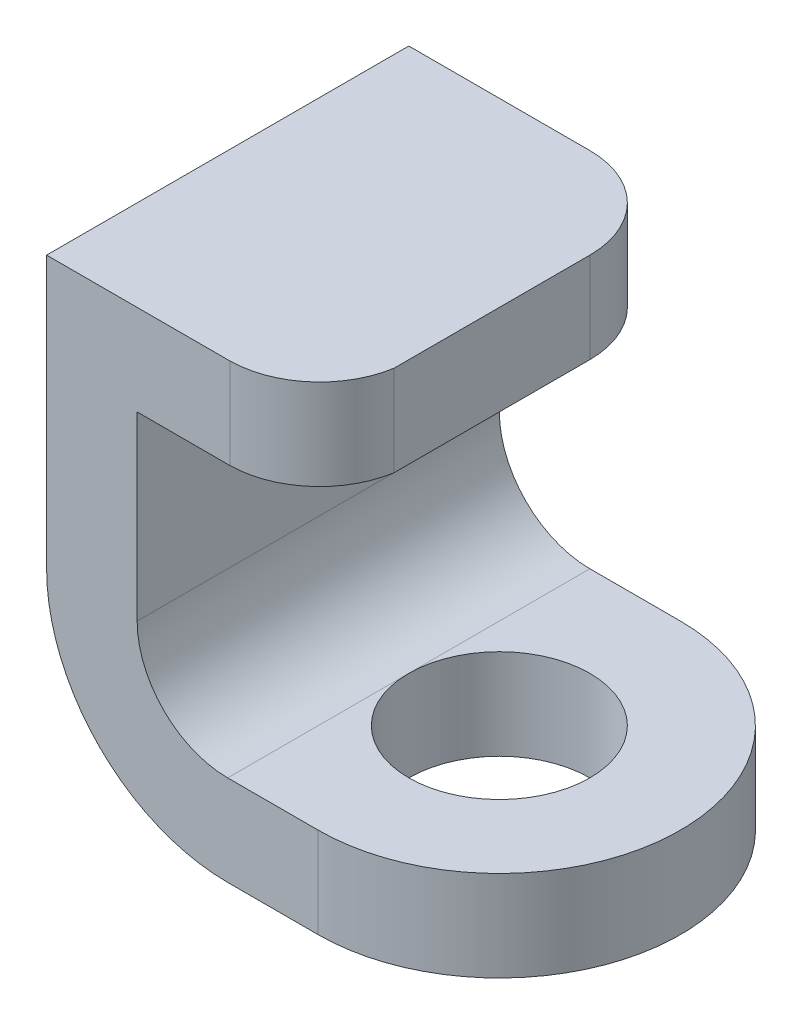
ISO-10303-21;
HEADER;
FILE_DESCRIPTION(('STEP AP214'),'2;1');
FILE_NAME('part.step','',(''),(''),'','','');
FILE_SCHEMA(('AUTOMOTIVE_DESIGN { 1 0 10303 214 1 1 1 1 }'));
ENDSEC;
DATA;
#1=APPLICATION_CONTEXT('core data for automotive mechanical design processes');
#2=APPLICATION_PROTOCOL_DEFINITION('international standard','automotive_design',2000,#1);
#3=PRODUCT_CONTEXT('',#1,'mechanical');
#4=PRODUCT('Part','Part','',(#3));
#5=PRODUCT_RELATED_PRODUCT_CATEGORY('part','',(#4));
#6=PRODUCT_DEFINITION_FORMATION('','',#4);
#7=PRODUCT_DEFINITION_CONTEXT('part definition',#1,'design');
#8=PRODUCT_DEFINITION('design','',#6,#7);
#9=PRODUCT_DEFINITION_SHAPE('','',#8);
#10=(LENGTH_UNIT() NAMED_UNIT(*) SI_UNIT(.MILLI.,.METRE.));
#11=(NAMED_UNIT(*) PLANE_ANGLE_UNIT() SI_UNIT($,.RADIAN.));
#12=(NAMED_UNIT(*) SI_UNIT($,.STERADIAN.) SOLID_ANGLE_UNIT());
#13=UNCERTAINTY_MEASURE_WITH_UNIT(LENGTH_MEASURE(1.E-05),#10,'distance_accuracy_value','');
#14=(GEOMETRIC_REPRESENTATION_CONTEXT(3) GLOBAL_UNCERTAINTY_ASSIGNED_CONTEXT((#13)) GLOBAL_UNIT_ASSIGNED_CONTEXT((#10,
#11,#12)) REPRESENTATION_CONTEXT('',''));
#15=CARTESIAN_POINT('',(0.,0.,0.));
#16=DIRECTION('',(0.,0.,1.));
#17=DIRECTION('',(1.,0.,0.));
#18=AXIS2_PLACEMENT_3D('',#15,#16,#17);
#19=CARTESIAN_POINT('',(-9.99999999999999,-50.,40.));
#20=DIRECTION('',(0.,1.,0.));
#21=DIRECTION('',(0.,0.,1.));
#22=AXIS2_PLACEMENT_3D('',#19,#20,#21);
#23=PLANE('',#22);
#24=CARTESIAN_POINT('',(0.,-50.,20.));
#25=DIRECTION('',(0.,1.,0.));
#26=DIRECTION('',(0.,0.,1.));
#27=AXIS2_PLACEMENT_3D('',#24,#25,#26);
#28=CIRCLE('',#27,20.);
#29=CARTESIAN_POINT('',(0.,-50.,40.));
#30=VERTEX_POINT('',#29);
#31=CARTESIAN_POINT('',(0.,-50.,0.));
#32=VERTEX_POINT('',#31);
#33=EDGE_CURVE('E178',#30,#32,#28,.T.);
#34=ORIENTED_EDGE('',*,*,#33,.F.);
#35=DIRECTION('',(1.,0.,0.));
#36=VECTOR('',#35,1.);
#37=CARTESIAN_POINT('',(-9.99999999999999,-50.,40.));
#38=LINE('',#37,#36);
#39=CARTESIAN_POINT('',(-10.,-50.,40.));
#40=VERTEX_POINT('',#39);
#41=EDGE_CURVE('E187',#40,#30,#38,.T.);
#42=ORIENTED_EDGE('',*,*,#41,.F.);
#43=DIRECTION('',(0.,0.,-1.));
#44=VECTOR('',#43,1.);
#45=CARTESIAN_POINT('',(-10.,-50.,40.));
#46=LINE('',#45,#44);
#47=CARTESIAN_POINT('',(-10.,-50.,20.));
#48=VERTEX_POINT('',#47);
#49=EDGE_CURVE('E230',#40,#48,#46,.T.);
#50=ORIENTED_EDGE('',*,*,#49,.T.);
#51=CARTESIAN_POINT('',(0.,-50.,20.));
#52=DIRECTION('',(0.,1.,0.));
#53=DIRECTION('',(0.,0.,1.));
#54=AXIS2_PLACEMENT_3D('',#51,#52,#53);
#55=CIRCLE('',#54,10.);
#56=EDGE_CURVE('E92',#48,#48,#55,.T.);
#57=ORIENTED_EDGE('',*,*,#56,.T.);
#58=CARTESIAN_POINT('',(-10.,-50.,0.));
#59=VERTEX_POINT('',#58);
#60=EDGE_CURVE('E209',#48,#59,#46,.T.);
#61=ORIENTED_EDGE('',*,*,#60,.T.);
#62=DIRECTION('',(1.,0.,0.));
#63=VECTOR('',#62,1.);
#64=CARTESIAN_POINT('',(-9.99999999999999,-50.,0.));
#65=LINE('',#64,#63);
#66=EDGE_CURVE('E210',#59,#32,#65,.T.);
#67=ORIENTED_EDGE('',*,*,#66,.T.);
#68=EDGE_LOOP('',(#34,#42,#50,#57,#61,#67));
#69=FACE_BOUND('',#68,.T.);
#70=ADVANCED_FACE('F75',(#69),#23,.F.);
#71=CARTESIAN_POINT('',(-9.99999999999999,-40.,40.));
#72=DIRECTION('',(0.,1.,0.));
#73=DIRECTION('',(0.,0.,1.));
#74=AXIS2_PLACEMENT_3D('',#71,#72,#73);
#75=PLANE('',#74);
#76=DIRECTION('',(1.,0.,0.));
#77=VECTOR('',#76,1.);
#78=CARTESIAN_POINT('',(-9.99999999999999,-40.,40.));
#79=LINE('',#78,#77);
#80=CARTESIAN_POINT('',(-10.,-40.,40.));
#81=VERTEX_POINT('',#80);
#82=CARTESIAN_POINT('',(0.,-40.,40.));
#83=VERTEX_POINT('',#82);
#84=EDGE_CURVE('E184',#81,#83,#79,.T.);
#85=ORIENTED_EDGE('',*,*,#84,.T.);
#86=CARTESIAN_POINT('',(0.,-40.,20.));
#87=DIRECTION('',(0.,1.,0.));
#88=DIRECTION('',(0.,0.,1.));
#89=AXIS2_PLACEMENT_3D('',#86,#87,#88);
#90=CIRCLE('',#89,20.);
#91=CARTESIAN_POINT('',(0.,-40.,0.));
#92=VERTEX_POINT('',#91);
#93=EDGE_CURVE('E167',#83,#92,#90,.T.);
#94=ORIENTED_EDGE('',*,*,#93,.T.);
#95=DIRECTION('',(1.,0.,0.));
#96=VECTOR('',#95,1.);
#97=CARTESIAN_POINT('',(-9.99999999999999,-40.,0.));
#98=LINE('',#97,#96);
#99=CARTESIAN_POINT('',(-10.,-40.,0.));
#100=VERTEX_POINT('',#99);
#101=EDGE_CURVE('E213',#100,#92,#98,.T.);
#102=ORIENTED_EDGE('',*,*,#101,.F.);
#103=DIRECTION('',(0.,0.,-1.));
#104=VECTOR('',#103,1.);
#105=CARTESIAN_POINT('',(-10.,-40.,40.));
#106=LINE('',#105,#104);
#107=CARTESIAN_POINT('',(-10.,-40.,20.));
#108=VERTEX_POINT('',#107);
#109=EDGE_CURVE('E249',#108,#100,#106,.T.);
#110=ORIENTED_EDGE('',*,*,#109,.F.);
#111=CARTESIAN_POINT('',(0.,-40.,20.));
#112=DIRECTION('',(0.,1.,0.));
#113=DIRECTION('',(0.,0.,1.));
#114=AXIS2_PLACEMENT_3D('',#111,#112,#113);
#115=CIRCLE('',#114,10.);
#116=EDGE_CURVE('E87',#108,#108,#115,.T.);
#117=ORIENTED_EDGE('',*,*,#116,.F.);
#118=EDGE_CURVE('E82',#81,#108,#106,.T.);
#119=ORIENTED_EDGE('',*,*,#118,.F.);
#120=EDGE_LOOP('',(#85,#94,#102,#110,#117,#119));
#121=FACE_BOUND('',#120,.T.);
#122=ADVANCED_FACE('F189',(#121),#75,.T.);
#123=CARTESIAN_POINT('',(-9.99999999999999,-30.,40.));
#124=DIRECTION('',(0.,0.,1.));
#125=DIRECTION('',(1.,0.,0.));
#126=AXIS2_PLACEMENT_3D('',#123,#124,#125);
#127=PLANE('',#126);
#128=ORIENTED_EDGE('',*,*,#41,.T.);
#129=DIRECTION('',(0.,1.,0.));
#130=VECTOR('',#129,1.);
#131=CARTESIAN_POINT('',(0.,-50.,40.));
#132=LINE('',#131,#130);
#133=EDGE_CURVE('E170',#30,#83,#132,.T.);
#134=ORIENTED_EDGE('',*,*,#133,.T.);
#135=ORIENTED_EDGE('',*,*,#84,.F.);
#136=CARTESIAN_POINT('',(-9.99999999999999,-30.,40.));
#137=DIRECTION('',(0.,0.,1.));
#138=DIRECTION('',(1.,0.,0.));
#139=AXIS2_PLACEMENT_3D('',#136,#137,#138);
#140=CIRCLE('',#139,10.);
#141=CARTESIAN_POINT('',(-20.,-30.,40.));
#142=VERTEX_POINT('',#141);
#143=EDGE_CURVE('E191',#142,#81,#140,.T.);
#144=ORIENTED_EDGE('',*,*,#143,.F.);
#145=DIRECTION('',(0.,-1.,0.));
#146=VECTOR('',#145,1.);
#147=CARTESIAN_POINT('',(-20.,0.,40.));
#148=LINE('',#147,#146);
#149=CARTESIAN_POINT('',(-20.,-10.,40.));
#150=VERTEX_POINT('',#149);
#151=EDGE_CURVE('E193',#150,#142,#148,.T.);
#152=ORIENTED_EDGE('',*,*,#151,.F.);
#153=DIRECTION('',(-1.,0.,0.));
#154=VECTOR('',#153,1.);
#155=CARTESIAN_POINT('',(0.,-10.,40.));
#156=LINE('',#155,#154);
#157=CARTESIAN_POINT('',(-9.72613862722199,-10.,40.));
#158=VERTEX_POINT('',#157);
#159=EDGE_CURVE('E201',#158,#150,#156,.T.);
#160=ORIENTED_EDGE('',*,*,#159,.F.);
#161=DIRECTION('',(0.,1.,0.));
#162=VECTOR('',#161,1.);
#163=CARTESIAN_POINT('',(-9.72613862722199,-10.,40.));
#164=LINE('',#163,#162);
#165=CARTESIAN_POINT('',(-9.72613862722199,0.,40.));
#166=VERTEX_POINT('',#165);
#167=EDGE_CURVE('E12',#158,#166,#164,.T.);
#168=ORIENTED_EDGE('',*,*,#167,.T.);
#169=DIRECTION('',(-1.,0.,0.));
#170=VECTOR('',#169,1.);
#171=CARTESIAN_POINT('',(0.,0.,40.));
#172=LINE('',#171,#170);
#173=CARTESIAN_POINT('',(-30.,0.,40.));
#174=VERTEX_POINT('',#173);
#175=EDGE_CURVE('E203',#166,#174,#172,.T.);
#176=ORIENTED_EDGE('',*,*,#175,.T.);
#177=DIRECTION('',(0.,-1.,0.));
#178=VECTOR('',#177,1.);
#179=CARTESIAN_POINT('',(-30.,0.,40.));
#180=LINE('',#179,#178);
#181=CARTESIAN_POINT('',(-30.,-30.,40.));
#182=VERTEX_POINT('',#181);
#183=EDGE_CURVE('E205',#174,#182,#180,.T.);
#184=ORIENTED_EDGE('',*,*,#183,.T.);
#185=CARTESIAN_POINT('',(-9.99999999999999,-30.,40.));
#186=DIRECTION('',(0.,0.,1.));
#187=DIRECTION('',(1.,0.,0.));
#188=AXIS2_PLACEMENT_3D('',#185,#186,#187);
#189=CIRCLE('',#188,20.);
#190=EDGE_CURVE('E207',#182,#40,#189,.T.);
#191=ORIENTED_EDGE('',*,*,#190,.T.);
#192=EDGE_LOOP('',(#128,#134,#135,#144,#152,#160,#168,#176,#184,#191));
#193=FACE_BOUND('',#192,.T.);
#194=ADVANCED_FACE('F182',(#193),#127,.T.);
#195=CARTESIAN_POINT('',(-9.99999999999999,-30.,0.));
#196=DIRECTION('',(0.,0.,1.));
#197=DIRECTION('',(1.,0.,0.));
#198=AXIS2_PLACEMENT_3D('',#195,#196,#197);
#199=PLANE('',#198);
#200=DIRECTION('',(0.,1.,0.));
#201=VECTOR('',#200,1.);
#202=CARTESIAN_POINT('',(0.,-50.,0.));
#203=LINE('',#202,#201);
#204=EDGE_CURVE('E173',#32,#92,#203,.T.);
#205=ORIENTED_EDGE('',*,*,#204,.F.);
#206=ORIENTED_EDGE('',*,*,#66,.F.);
#207=CARTESIAN_POINT('',(-9.99999999999999,-30.,0.));
#208=DIRECTION('',(0.,0.,1.));
#209=DIRECTION('',(1.,0.,0.));
#210=AXIS2_PLACEMENT_3D('',#207,#208,#209);
#211=CIRCLE('',#210,20.);
#212=CARTESIAN_POINT('',(-30.,-30.,0.));
#213=VERTEX_POINT('',#212);
#214=EDGE_CURVE('E195',#213,#59,#211,.T.);
#215=ORIENTED_EDGE('',*,*,#214,.F.);
#216=DIRECTION('',(0.,-1.,0.));
#217=VECTOR('',#216,1.);
#218=CARTESIAN_POINT('',(-30.,0.,0.));
#219=LINE('',#218,#217);
#220=CARTESIAN_POINT('',(-30.,0.,0.));
#221=VERTEX_POINT('',#220);
#222=EDGE_CURVE('E226',#221,#213,#219,.T.);
#223=ORIENTED_EDGE('',*,*,#222,.F.);
#224=DIRECTION('',(-1.,0.,0.));
#225=VECTOR('',#224,1.);
#226=CARTESIAN_POINT('',(0.,0.,0.));
#227=LINE('',#226,#225);
#228=CARTESIAN_POINT('',(-10.,0.,0.));
#229=VERTEX_POINT('',#228);
#230=EDGE_CURVE('E224',#229,#221,#227,.T.);
#231=ORIENTED_EDGE('',*,*,#230,.F.);
#232=DIRECTION('',(0.,1.,0.));
#233=VECTOR('',#232,1.);
#234=CARTESIAN_POINT('',(-9.99999999999999,-10.,0.));
#235=LINE('',#234,#233);
#236=CARTESIAN_POINT('',(-9.99999999999999,-10.,0.));
#237=VERTEX_POINT('',#236);
#238=EDGE_CURVE('E279',#237,#229,#235,.T.);
#239=ORIENTED_EDGE('',*,*,#238,.F.);
#240=DIRECTION('',(-1.,0.,0.));
#241=VECTOR('',#240,1.);
#242=CARTESIAN_POINT('',(0.,-10.,0.));
#243=LINE('',#242,#241);
#244=CARTESIAN_POINT('',(-20.,-10.,0.));
#245=VERTEX_POINT('',#244);
#246=EDGE_CURVE('E222',#237,#245,#243,.T.);
#247=ORIENTED_EDGE('',*,*,#246,.T.);
#248=DIRECTION('',(0.,-1.,0.));
#249=VECTOR('',#248,1.);
#250=CARTESIAN_POINT('',(-20.,0.,0.));
#251=LINE('',#250,#249);
#252=CARTESIAN_POINT('',(-20.,-30.,0.));
#253=VERTEX_POINT('',#252);
#254=EDGE_CURVE('E219',#245,#253,#251,.T.);
#255=ORIENTED_EDGE('',*,*,#254,.T.);
#256=CARTESIAN_POINT('',(-9.99999999999999,-30.,0.));
#257=DIRECTION('',(0.,0.,1.));
#258=DIRECTION('',(1.,0.,0.));
#259=AXIS2_PLACEMENT_3D('',#256,#257,#258);
#260=CIRCLE('',#259,10.);
#261=EDGE_CURVE('E216',#253,#100,#260,.T.);
#262=ORIENTED_EDGE('',*,*,#261,.T.);
#263=ORIENTED_EDGE('',*,*,#101,.T.);
#264=EDGE_LOOP('',(#205,#206,#215,#223,#231,#239,#247,#255,#262,#263));
#265=FACE_BOUND('',#264,.T.);
#266=ADVANCED_FACE('F255',(#265),#199,.F.);
#267=CARTESIAN_POINT('',(0.,-10.,40.));
#268=DIRECTION('',(0.,-1.,0.));
#269=DIRECTION('',(1.,0.,0.));
#270=AXIS2_PLACEMENT_3D('',#267,#268,#269);
#271=PLANE('',#270);
#272=ORIENTED_EDGE('',*,*,#246,.F.);
#273=CARTESIAN_POINT('',(-10.,-10.,10.));
#274=DIRECTION('',(0.,1.,0.));
#275=DIRECTION('',(-1.,0.,0.));
#276=AXIS2_PLACEMENT_3D('',#273,#274,#275);
#277=CIRCLE('',#276,10.);
#278=CARTESIAN_POINT('',(0.,-10.,10.));
#279=VERTEX_POINT('',#278);
#280=EDGE_CURVE('E281',#279,#237,#277,.T.);
#281=ORIENTED_EDGE('',*,*,#280,.F.);
#282=DIRECTION('',(0.,0.,-1.));
#283=VECTOR('',#282,1.);
#284=CARTESIAN_POINT('',(0.,-10.,40.));
#285=LINE('',#284,#283);
#286=CARTESIAN_POINT('',(0.,-10.,31.6501384768344));
#287=VERTEX_POINT('',#286);
#288=EDGE_CURVE('E242',#287,#279,#285,.T.);
#289=ORIENTED_EDGE('',*,*,#288,.F.);
#290=CARTESIAN_POINT('',(-9.86306931361099,-10.,30.0009375445932));
#291=DIRECTION('',(0.,1.,0.));
#292=DIRECTION('',(-1.,0.,0.));
#293=AXIS2_PLACEMENT_3D('',#290,#291,#292);
#294=CIRCLE('',#293,10.);
#295=EDGE_CURVE('E269',#158,#287,#294,.T.);
#296=ORIENTED_EDGE('',*,*,#295,.F.);
#297=ORIENTED_EDGE('',*,*,#159,.T.);
#298=DIRECTION('',(0.,0.,-1.));
#299=VECTOR('',#298,1.);
#300=CARTESIAN_POINT('',(-20.,-10.,40.));
#301=LINE('',#300,#299);
#302=EDGE_CURVE('E245',#150,#245,#301,.T.);
#303=ORIENTED_EDGE('',*,*,#302,.T.);
#304=EDGE_LOOP('',(#272,#281,#289,#296,#297,#303));
#305=FACE_BOUND('',#304,.T.);
#306=ADVANCED_FACE('F267',(#305),#271,.T.);
#307=CARTESIAN_POINT('',(0.,0.,40.));
#308=DIRECTION('',(1.,0.,0.));
#309=DIRECTION('',(0.,1.,0.));
#310=AXIS2_PLACEMENT_3D('',#307,#308,#309);
#311=PLANE('',#310);
#312=ORIENTED_EDGE('',*,*,#288,.T.);
#313=DIRECTION('',(0.,1.,0.));
#314=VECTOR('',#313,1.);
#315=CARTESIAN_POINT('',(0.,-10.,10.));
#316=LINE('',#315,#314);
#317=CARTESIAN_POINT('',(0.,0.,10.));
#318=VERTEX_POINT('',#317);
#319=EDGE_CURVE('E276',#279,#318,#316,.T.);
#320=ORIENTED_EDGE('',*,*,#319,.T.);
#321=DIRECTION('',(0.,0.,-1.));
#322=VECTOR('',#321,1.);
#323=CARTESIAN_POINT('',(0.,0.,40.));
#324=LINE('',#323,#322);
#325=CARTESIAN_POINT('',(0.,0.,31.6501384768344));
#326=VERTEX_POINT('',#325);
#327=EDGE_CURVE('E239',#326,#318,#324,.T.);
#328=ORIENTED_EDGE('',*,*,#327,.F.);
#329=DIRECTION('',(0.,1.,0.));
#330=VECTOR('',#329,1.);
#331=CARTESIAN_POINT('',(0.,-10.,31.6501384768344));
#332=LINE('',#331,#330);
#333=EDGE_CURVE('E214',#287,#326,#332,.T.);
#334=ORIENTED_EDGE('',*,*,#333,.F.);
#335=EDGE_LOOP('',(#312,#320,#328,#334));
#336=FACE_BOUND('',#335,.T.);
#337=ADVANCED_FACE('F312',(#336),#311,.T.);
#338=CARTESIAN_POINT('',(0.,0.,40.));
#339=DIRECTION('',(0.,-1.,0.));
#340=DIRECTION('',(1.,0.,0.));
#341=AXIS2_PLACEMENT_3D('',#338,#339,#340);
#342=PLANE('',#341);
#343=CARTESIAN_POINT('',(-10.,0.,10.));
#344=DIRECTION('',(0.,1.,0.));
#345=DIRECTION('',(-1.,0.,0.));
#346=AXIS2_PLACEMENT_3D('',#343,#344,#345);
#347=CIRCLE('',#346,10.);
#348=EDGE_CURVE('E284',#318,#229,#347,.T.);
#349=ORIENTED_EDGE('',*,*,#348,.T.);
#350=ORIENTED_EDGE('',*,*,#230,.T.);
#351=DIRECTION('',(0.,0.,-1.));
#352=VECTOR('',#351,1.);
#353=CARTESIAN_POINT('',(-30.,0.,40.));
#354=LINE('',#353,#352);
#355=EDGE_CURVE('E236',#174,#221,#354,.T.);
#356=ORIENTED_EDGE('',*,*,#355,.F.);
#357=ORIENTED_EDGE('',*,*,#175,.F.);
#358=CARTESIAN_POINT('',(-9.863069313611,0.,30.0009375445932));
#359=DIRECTION('',(0.,1.,0.));
#360=DIRECTION('',(-1.,0.,0.));
#361=AXIS2_PLACEMENT_3D('',#358,#359,#360);
#362=CIRCLE('',#361,10.);
#363=EDGE_CURVE('E273',#166,#326,#362,.T.);
#364=ORIENTED_EDGE('',*,*,#363,.T.);
#365=ORIENTED_EDGE('',*,*,#327,.T.);
#366=EDGE_LOOP('',(#349,#350,#356,#357,#364,#365));
#367=FACE_BOUND('',#366,.T.);
#368=ADVANCED_FACE('F307',(#367),#342,.F.);
#369=CARTESIAN_POINT('',(-9.99999999999999,-30.,40.));
#370=DIRECTION('',(0.,0.,-1.));
#371=DIRECTION('',(-1.,0.,0.));
#372=AXIS2_PLACEMENT_3D('',#369,#370,#371);
#373=CYLINDRICAL_SURFACE('',#372,10.);
#374=ORIENTED_EDGE('',*,*,#261,.F.);
#375=DIRECTION('',(0.,0.,-1.));
#376=VECTOR('',#375,1.);
#377=CARTESIAN_POINT('',(-20.,-30.,40.));
#378=LINE('',#377,#376);
#379=EDGE_CURVE('E248',#142,#253,#378,.T.);
#380=ORIENTED_EDGE('',*,*,#379,.F.);
#381=ORIENTED_EDGE('',*,*,#143,.T.);
#382=ORIENTED_EDGE('',*,*,#118,.T.);
#383=ORIENTED_EDGE('',*,*,#109,.T.);
#384=EDGE_LOOP('',(#374,#380,#381,#382,#383));
#385=FACE_BOUND('',#384,.T.);
#386=ADVANCED_FACE('F253',(#385),#373,.F.);
#387=CARTESIAN_POINT('',(-20.,0.,40.));
#388=DIRECTION('',(1.,0.,0.));
#389=DIRECTION('',(0.,1.,0.));
#390=AXIS2_PLACEMENT_3D('',#387,#388,#389);
#391=PLANE('',#390);
#392=ORIENTED_EDGE('',*,*,#254,.F.);
#393=ORIENTED_EDGE('',*,*,#302,.F.);
#394=ORIENTED_EDGE('',*,*,#151,.T.);
#395=ORIENTED_EDGE('',*,*,#379,.T.);
#396=EDGE_LOOP('',(#392,#393,#394,#395));
#397=FACE_BOUND('',#396,.T.);
#398=ADVANCED_FACE('F261',(#397),#391,.T.);
#399=CARTESIAN_POINT('',(-30.,0.,40.));
#400=DIRECTION('',(1.,0.,0.));
#401=DIRECTION('',(0.,1.,0.));
#402=AXIS2_PLACEMENT_3D('',#399,#400,#401);
#403=PLANE('',#402);
#404=ORIENTED_EDGE('',*,*,#222,.T.);
#405=DIRECTION('',(0.,0.,-1.));
#406=VECTOR('',#405,1.);
#407=CARTESIAN_POINT('',(-30.,-30.,40.));
#408=LINE('',#407,#406);
#409=EDGE_CURVE('E233',#182,#213,#408,.T.);
#410=ORIENTED_EDGE('',*,*,#409,.F.);
#411=ORIENTED_EDGE('',*,*,#183,.F.);
#412=ORIENTED_EDGE('',*,*,#355,.T.);
#413=EDGE_LOOP('',(#404,#410,#411,#412));
#414=FACE_BOUND('',#413,.T.);
#415=ADVANCED_FACE('F303',(#414),#403,.F.);
#416=CARTESIAN_POINT('',(-9.99999999999999,-30.,40.));
#417=DIRECTION('',(0.,0.,-1.));
#418=DIRECTION('',(-1.,0.,0.));
#419=AXIS2_PLACEMENT_3D('',#416,#417,#418);
#420=CYLINDRICAL_SURFACE('',#419,20.);
#421=ORIENTED_EDGE('',*,*,#214,.T.);
#422=ORIENTED_EDGE('',*,*,#60,.F.);
#423=ORIENTED_EDGE('',*,*,#49,.F.);
#424=ORIENTED_EDGE('',*,*,#190,.F.);
#425=ORIENTED_EDGE('',*,*,#409,.T.);
#426=EDGE_LOOP('',(#421,#422,#423,#424,#425));
#427=FACE_BOUND('',#426,.T.);
#428=ADVANCED_FACE('F295',(#427),#420,.T.);
#429=CARTESIAN_POINT('',(-9.86306931361099,-10.,30.0009375445932));
#430=DIRECTION('',(0.,1.,0.));
#431=DIRECTION('',(-1.,0.,0.));
#432=AXIS2_PLACEMENT_3D('',#429,#430,#431);
#433=CYLINDRICAL_SURFACE('',#432,10.);
#434=ORIENTED_EDGE('',*,*,#295,.T.);
#435=ORIENTED_EDGE('',*,*,#333,.T.);
#436=ORIENTED_EDGE('',*,*,#363,.F.);
#437=ORIENTED_EDGE('',*,*,#167,.F.);
#438=EDGE_LOOP('',(#434,#435,#436,#437));
#439=FACE_BOUND('',#438,.T.);
#440=ADVANCED_FACE('F313',(#439),#433,.T.);
#441=CARTESIAN_POINT('',(-10.,-10.,10.));
#442=DIRECTION('',(0.,1.,0.));
#443=DIRECTION('',(-1.,0.,0.));
#444=AXIS2_PLACEMENT_3D('',#441,#442,#443);
#445=CYLINDRICAL_SURFACE('',#444,10.);
#446=ORIENTED_EDGE('',*,*,#348,.F.);
#447=ORIENTED_EDGE('',*,*,#319,.F.);
#448=ORIENTED_EDGE('',*,*,#280,.T.);
#449=ORIENTED_EDGE('',*,*,#238,.T.);
#450=EDGE_LOOP('',(#446,#447,#448,#449));
#451=FACE_BOUND('',#450,.T.);
#452=ADVANCED_FACE('F310',(#451),#445,.T.);
#453=CARTESIAN_POINT('',(0.,-50.,20.));
#454=DIRECTION('',(0.,1.,0.));
#455=DIRECTION('',(0.,0.,1.));
#456=AXIS2_PLACEMENT_3D('',#453,#454,#455);
#457=CYLINDRICAL_SURFACE('',#456,20.);
#458=ORIENTED_EDGE('',*,*,#93,.F.);
#459=ORIENTED_EDGE('',*,*,#133,.F.);
#460=ORIENTED_EDGE('',*,*,#33,.T.);
#461=ORIENTED_EDGE('',*,*,#204,.T.);
#462=EDGE_LOOP('',(#458,#459,#460,#461));
#463=FACE_BOUND('',#462,.T.);
#464=ADVANCED_FACE('F169',(#463),#457,.T.);
#465=CARTESIAN_POINT('',(0.,-50.,20.));
#466=DIRECTION('',(0.,1.,0.));
#467=DIRECTION('',(0.,0.,1.));
#468=AXIS2_PLACEMENT_3D('',#465,#466,#467);
#469=CYLINDRICAL_SURFACE('',#468,10.);
#470=ORIENTED_EDGE('',*,*,#56,.F.);
#471=EDGE_LOOP('',(#470));
#472=FACE_BOUND('',#471,.T.);
#473=ORIENTED_EDGE('',*,*,#116,.T.);
#474=EDGE_LOOP('',(#473));
#475=FACE_BOUND('',#474,.T.);
#476=ADVANCED_FACE('F385',(#472,#475),#469,.F.);
#477=CLOSED_SHELL('',(#70,#122,#194,#266,#306,#337,#368,#386,#398,#415,#428,#440,#452,#464,#476));
#478=MANIFOLD_SOLID_BREP('B2',#477);
#479=ADVANCED_BREP_SHAPE_REPRESENTATION('',(#18,#478),#14);
#480=SHAPE_DEFINITION_REPRESENTATION(#9,#479);
ENDSEC;
END-ISO-10303-21;
